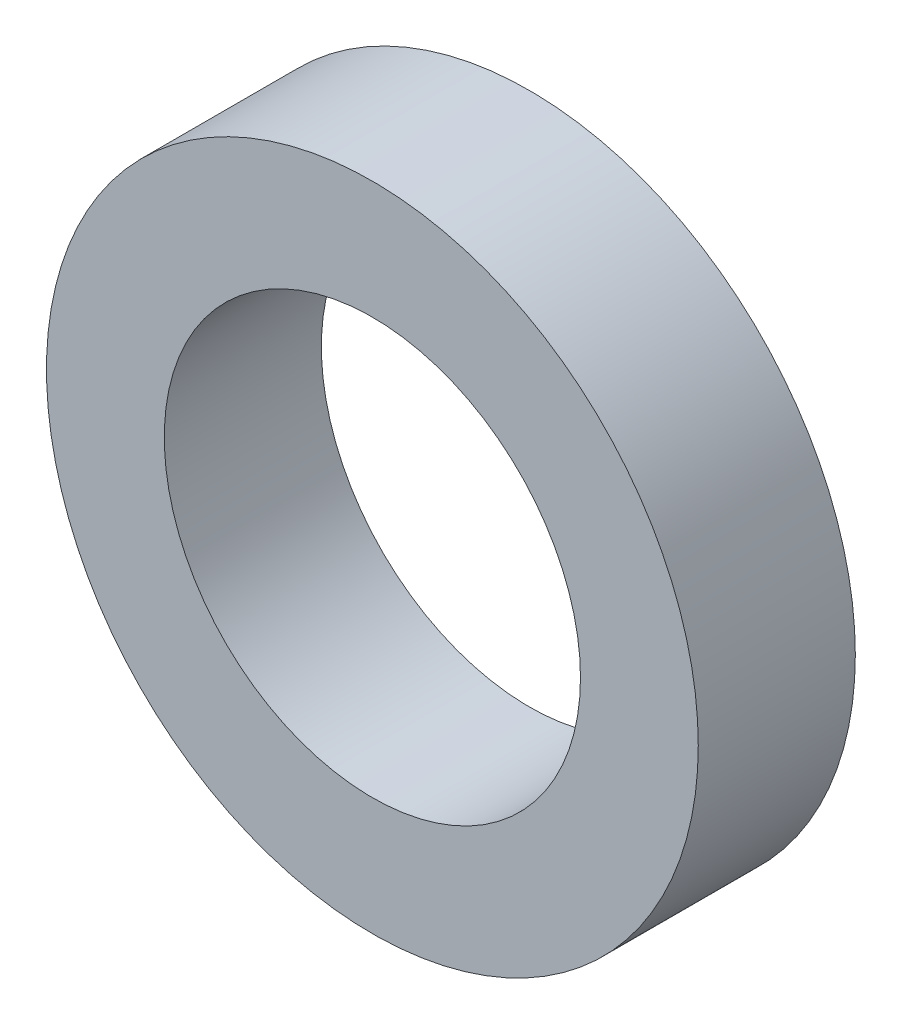
ISO-10303-21;
HEADER;
FILE_DESCRIPTION(('STEP AP214'),'2;1');
FILE_NAME('part.step','',(''),(''),'','','');
FILE_SCHEMA(('AUTOMOTIVE_DESIGN { 1 0 10303 214 1 1 1 1 }'));
ENDSEC;
DATA;
#1=APPLICATION_CONTEXT('core data for automotive mechanical design processes');
#2=APPLICATION_PROTOCOL_DEFINITION('international standard','automotive_design',2000,#1);
#3=PRODUCT_CONTEXT('',#1,'mechanical');
#4=PRODUCT('Part','Part','',(#3));
#5=PRODUCT_RELATED_PRODUCT_CATEGORY('part','',(#4));
#6=PRODUCT_DEFINITION_FORMATION('','',#4);
#7=PRODUCT_DEFINITION_CONTEXT('part definition',#1,'design');
#8=PRODUCT_DEFINITION('design','',#6,#7);
#9=PRODUCT_DEFINITION_SHAPE('','',#8);
#10=(LENGTH_UNIT() NAMED_UNIT(*) SI_UNIT(.MILLI.,.METRE.));
#11=(NAMED_UNIT(*) PLANE_ANGLE_UNIT() SI_UNIT($,.RADIAN.));
#12=(NAMED_UNIT(*) SI_UNIT($,.STERADIAN.) SOLID_ANGLE_UNIT());
#13=UNCERTAINTY_MEASURE_WITH_UNIT(LENGTH_MEASURE(1.E-05),#10,'distance_accuracy_value','');
#14=(GEOMETRIC_REPRESENTATION_CONTEXT(3) GLOBAL_UNCERTAINTY_ASSIGNED_CONTEXT((#13)) GLOBAL_UNIT_ASSIGNED_CONTEXT((#10,
#11,#12)) REPRESENTATION_CONTEXT('',''));
#15=CARTESIAN_POINT('',(0.,0.,0.));
#16=DIRECTION('',(0.,0.,1.));
#17=DIRECTION('',(1.,0.,0.));
#18=AXIS2_PLACEMENT_3D('',#15,#16,#17);
#19=CARTESIAN_POINT('',(0.,0.,2.));
#20=DIRECTION('',(0.,0.,1.));
#21=DIRECTION('',(1.,0.,0.));
#22=AXIS2_PLACEMENT_3D('',#19,#20,#21);
#23=PLANE('',#22);
#24=CARTESIAN_POINT('',(0.,0.,2.));
#25=DIRECTION('',(0.,0.,1.));
#26=DIRECTION('',(1.,0.,0.));
#27=AXIS2_PLACEMENT_3D('',#24,#25,#26);
#28=CIRCLE('',#27,4.15);
#29=CARTESIAN_POINT('',(4.15,0.,2.));
#30=VERTEX_POINT('',#29);
#31=EDGE_CURVE('E10',#30,#30,#28,.T.);
#32=ORIENTED_EDGE('',*,*,#31,.T.);
#33=EDGE_LOOP('',(#32));
#34=FACE_BOUND('',#33,.T.);
#35=CARTESIAN_POINT('',(0.,0.,2.));
#36=DIRECTION('',(0.,0.,1.));
#37=DIRECTION('',(1.,0.,0.));
#38=AXIS2_PLACEMENT_3D('',#35,#36,#37);
#39=CIRCLE('',#38,2.65);
#40=CARTESIAN_POINT('',(2.65,0.,2.));
#41=VERTEX_POINT('',#40);
#42=EDGE_CURVE('E54',#41,#41,#39,.T.);
#43=ORIENTED_EDGE('',*,*,#42,.F.);
#44=EDGE_LOOP('',(#43));
#45=FACE_BOUND('',#44,.T.);
#46=ADVANCED_FACE('F41',(#34,#45),#23,.T.);
#47=CARTESIAN_POINT('',(0.,0.,0.));
#48=DIRECTION('',(0.,0.,1.));
#49=DIRECTION('',(1.,0.,0.));
#50=AXIS2_PLACEMENT_3D('',#47,#48,#49);
#51=PLANE('',#50);
#52=CARTESIAN_POINT('',(0.,0.,0.));
#53=DIRECTION('',(0.,0.,1.));
#54=DIRECTION('',(1.,0.,0.));
#55=AXIS2_PLACEMENT_3D('',#52,#53,#54);
#56=CIRCLE('',#55,4.15);
#57=CARTESIAN_POINT('',(4.15,0.,0.));
#58=VERTEX_POINT('',#57);
#59=EDGE_CURVE('E45',#58,#58,#56,.T.);
#60=ORIENTED_EDGE('',*,*,#59,.F.);
#61=EDGE_LOOP('',(#60));
#62=FACE_BOUND('',#61,.T.);
#63=CARTESIAN_POINT('',(0.,0.,0.));
#64=DIRECTION('',(0.,0.,1.));
#65=DIRECTION('',(1.,0.,0.));
#66=AXIS2_PLACEMENT_3D('',#63,#64,#65);
#67=CIRCLE('',#66,2.65);
#68=CARTESIAN_POINT('',(2.65,0.,0.));
#69=VERTEX_POINT('',#68);
#70=EDGE_CURVE('E56',#69,#69,#67,.T.);
#71=ORIENTED_EDGE('',*,*,#70,.T.);
#72=EDGE_LOOP('',(#71));
#73=FACE_BOUND('',#72,.T.);
#74=ADVANCED_FACE('F68',(#62,#73),#51,.F.);
#75=CARTESIAN_POINT('',(0.,0.,2.));
#76=DIRECTION('',(0.,0.,-1.));
#77=DIRECTION('',(-1.,0.,0.));
#78=AXIS2_PLACEMENT_3D('',#75,#76,#77);
#79=CYLINDRICAL_SURFACE('',#78,4.15);
#80=ORIENTED_EDGE('',*,*,#31,.F.);
#81=EDGE_LOOP('',(#80));
#82=FACE_BOUND('',#81,.T.);
#83=ORIENTED_EDGE('',*,*,#59,.T.);
#84=EDGE_LOOP('',(#83));
#85=FACE_BOUND('',#84,.T.);
#86=ADVANCED_FACE('F43',(#82,#85),#79,.T.);
#87=CARTESIAN_POINT('',(0.,0.,2.));
#88=DIRECTION('',(0.,0.,-1.));
#89=DIRECTION('',(-1.,0.,0.));
#90=AXIS2_PLACEMENT_3D('',#87,#88,#89);
#91=CYLINDRICAL_SURFACE('',#90,2.65);
#92=ORIENTED_EDGE('',*,*,#42,.T.);
#93=EDGE_LOOP('',(#92));
#94=FACE_BOUND('',#93,.T.);
#95=ORIENTED_EDGE('',*,*,#70,.F.);
#96=EDGE_LOOP('',(#95));
#97=FACE_BOUND('',#96,.T.);
#98=ADVANCED_FACE('F64',(#94,#97),#91,.F.);
#99=CLOSED_SHELL('',(#46,#74,#86,#98));
#100=MANIFOLD_SOLID_BREP('B2',#99);
#101=ADVANCED_BREP_SHAPE_REPRESENTATION('',(#18,#100),#14);
#102=SHAPE_DEFINITION_REPRESENTATION(#9,#101);
ENDSEC;
END-ISO-10303-21;
